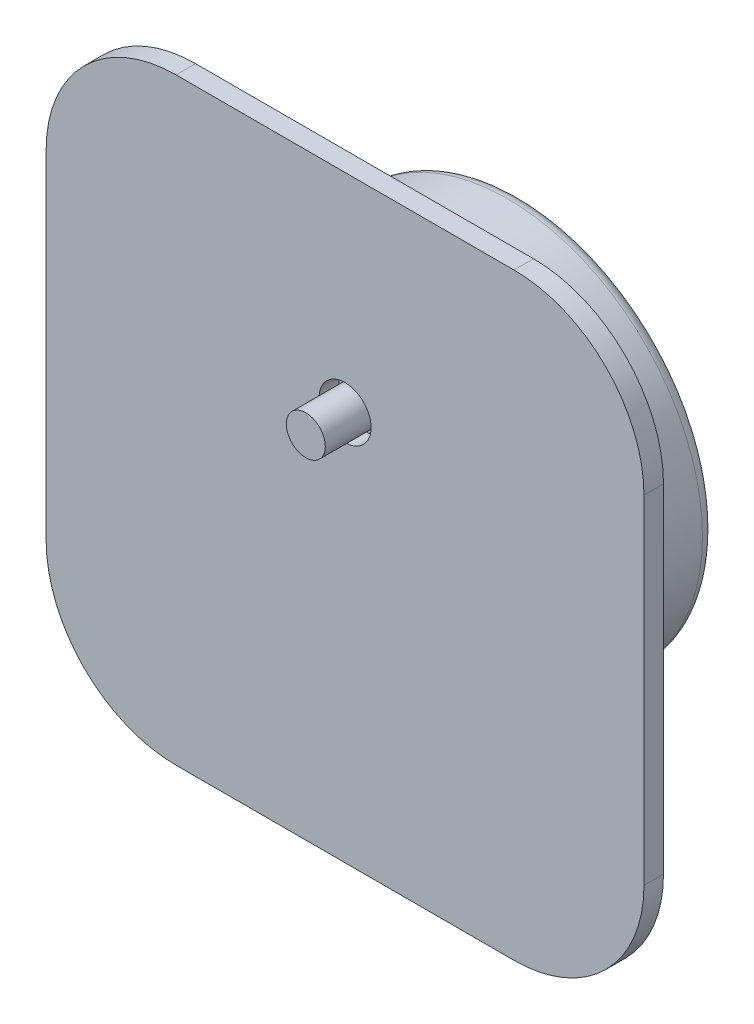
ISO-10303-21;
HEADER;
FILE_DESCRIPTION(('STEP AP214'),'2;1');
FILE_NAME('part.step','',(''),(''),'','','');
FILE_SCHEMA(('AUTOMOTIVE_DESIGN { 1 0 10303 214 1 1 1 1 }'));
ENDSEC;
DATA;
#1=APPLICATION_CONTEXT('core data for automotive mechanical design processes');
#2=APPLICATION_PROTOCOL_DEFINITION('international standard','automotive_design',2000,#1);
#3=PRODUCT_CONTEXT('',#1,'mechanical');
#4=PRODUCT('Part','Part','',(#3));
#5=PRODUCT_RELATED_PRODUCT_CATEGORY('part','',(#4));
#6=PRODUCT_DEFINITION_FORMATION('','',#4);
#7=PRODUCT_DEFINITION_CONTEXT('part definition',#1,'design');
#8=PRODUCT_DEFINITION('design','',#6,#7);
#9=PRODUCT_DEFINITION_SHAPE('','',#8);
#10=(LENGTH_UNIT() NAMED_UNIT(*) SI_UNIT(.MILLI.,.METRE.));
#11=(NAMED_UNIT(*) PLANE_ANGLE_UNIT() SI_UNIT($,.RADIAN.));
#12=(NAMED_UNIT(*) SI_UNIT($,.STERADIAN.) SOLID_ANGLE_UNIT());
#13=UNCERTAINTY_MEASURE_WITH_UNIT(LENGTH_MEASURE(1.E-05),#10,'distance_accuracy_value','');
#14=(GEOMETRIC_REPRESENTATION_CONTEXT(3) GLOBAL_UNCERTAINTY_ASSIGNED_CONTEXT((#13)) GLOBAL_UNIT_ASSIGNED_CONTEXT((#10,
#11,#12)) REPRESENTATION_CONTEXT('',''));
#15=CARTESIAN_POINT('',(0.,0.,0.));
#16=DIRECTION('',(0.,0.,1.));
#17=DIRECTION('',(1.,0.,0.));
#18=AXIS2_PLACEMENT_3D('',#15,#16,#17);
#19=CARTESIAN_POINT('',(0.,0.,1.5));
#20=DIRECTION('',(0.,0.,-1.));
#21=DIRECTION('',(-1.,0.,0.));
#22=AXIS2_PLACEMENT_3D('',#19,#20,#21);
#23=PLANE('',#22);
#24=DIRECTION('',(0.,-1.,0.));
#25=VECTOR('',#24,1.);
#26=CARTESIAN_POINT('',(-23.,-23.,1.5));
#27=LINE('',#26,#25);
#28=CARTESIAN_POINT('',(-23.,13.,1.5));
#29=VERTEX_POINT('',#28);
#30=CARTESIAN_POINT('',(-23.,-13.,1.5));
#31=VERTEX_POINT('',#30);
#32=EDGE_CURVE('E188',#29,#31,#27,.T.);
#33=ORIENTED_EDGE('',*,*,#32,.T.);
#34=CARTESIAN_POINT('',(-13.,-13.,1.5));
#35=DIRECTION('',(0.,0.,-1.));
#36=DIRECTION('',(-1.,0.,0.));
#37=AXIS2_PLACEMENT_3D('',#34,#35,#36);
#38=CIRCLE('',#37,10.);
#39=CARTESIAN_POINT('',(-13.,-23.,1.5));
#40=VERTEX_POINT('',#39);
#41=EDGE_CURVE('E286',#31,#40,#38,.F.);
#42=ORIENTED_EDGE('',*,*,#41,.T.);
#43=DIRECTION('',(1.,0.,0.));
#44=VECTOR('',#43,1.);
#45=CARTESIAN_POINT('',(-23.,-23.,1.5));
#46=LINE('',#45,#44);
#47=CARTESIAN_POINT('',(13.,-23.,1.5));
#48=VERTEX_POINT('',#47);
#49=EDGE_CURVE('E191',#40,#48,#46,.T.);
#50=ORIENTED_EDGE('',*,*,#49,.T.);
#51=CARTESIAN_POINT('',(13.,-13.,1.5));
#52=DIRECTION('',(0.,0.,-1.));
#53=DIRECTION('',(-1.,0.,0.));
#54=AXIS2_PLACEMENT_3D('',#51,#52,#53);
#55=CIRCLE('',#54,10.);
#56=CARTESIAN_POINT('',(23.,-13.,1.5));
#57=VERTEX_POINT('',#56);
#58=EDGE_CURVE('E291',#48,#57,#55,.F.);
#59=ORIENTED_EDGE('',*,*,#58,.T.);
#60=DIRECTION('',(0.,1.,0.));
#61=VECTOR('',#60,1.);
#62=CARTESIAN_POINT('',(23.,-23.,1.5));
#63=LINE('',#62,#61);
#64=CARTESIAN_POINT('',(23.,13.,1.5));
#65=VERTEX_POINT('',#64);
#66=EDGE_CURVE('E183',#57,#65,#63,.T.);
#67=ORIENTED_EDGE('',*,*,#66,.T.);
#68=CARTESIAN_POINT('',(13.,13.,1.5));
#69=DIRECTION('',(0.,0.,-1.));
#70=DIRECTION('',(-1.,0.,0.));
#71=AXIS2_PLACEMENT_3D('',#68,#69,#70);
#72=CIRCLE('',#71,10.);
#73=CARTESIAN_POINT('',(13.,23.,1.5));
#74=VERTEX_POINT('',#73);
#75=EDGE_CURVE('E58',#65,#74,#72,.F.);
#76=ORIENTED_EDGE('',*,*,#75,.T.);
#77=DIRECTION('',(-1.,0.,0.));
#78=VECTOR('',#77,1.);
#79=CARTESIAN_POINT('',(-23.,23.,1.5));
#80=LINE('',#79,#78);
#81=CARTESIAN_POINT('',(-13.,23.,1.5));
#82=VERTEX_POINT('',#81);
#83=EDGE_CURVE('E185',#74,#82,#80,.T.);
#84=ORIENTED_EDGE('',*,*,#83,.T.);
#85=CARTESIAN_POINT('',(-13.,13.,1.5));
#86=DIRECTION('',(0.,0.,-1.));
#87=DIRECTION('',(-1.,0.,0.));
#88=AXIS2_PLACEMENT_3D('',#85,#86,#87);
#89=CIRCLE('',#88,10.);
#90=EDGE_CURVE('E284',#82,#29,#89,.F.);
#91=ORIENTED_EDGE('',*,*,#90,.T.);
#92=EDGE_LOOP('',(#33,#42,#50,#59,#67,#76,#84,#91));
#93=FACE_BOUND('',#92,.T.);
#94=CARTESIAN_POINT('',(0.,7.,1.5));
#95=DIRECTION('',(0.,0.,1.));
#96=DIRECTION('',(1.,0.,0.));
#97=AXIS2_PLACEMENT_3D('',#94,#95,#96);
#98=CIRCLE('',#97,2.);
#99=CARTESIAN_POINT('',(2.,7.,1.5));
#100=VERTEX_POINT('',#99);
#101=EDGE_CURVE('E177',#100,#100,#98,.T.);
#102=ORIENTED_EDGE('',*,*,#101,.F.);
#103=EDGE_LOOP('',(#102));
#104=FACE_BOUND('',#103,.T.);
#105=ADVANCED_FACE('F36',(#93,#104),#23,.F.);
#106=CARTESIAN_POINT('',(0.,0.,0.));
#107=DIRECTION('',(0.,0.,-1.));
#108=DIRECTION('',(-1.,0.,0.));
#109=AXIS2_PLACEMENT_3D('',#106,#107,#108);
#110=PLANE('',#109);
#111=DIRECTION('',(-1.,0.,0.));
#112=VECTOR('',#111,1.);
#113=CARTESIAN_POINT('',(-16.0452967958349,-5.50147784542147,0.));
#114=LINE('',#113,#112);
#115=CARTESIAN_POINT('',(-13.9547032041651,-5.50147784542147,0.));
#116=VERTEX_POINT('',#115);
#117=CARTESIAN_POINT('',(-16.0452967958349,-5.50147784542147,0.));
#118=VERTEX_POINT('',#117);
#119=EDGE_CURVE('E149',#116,#118,#114,.T.);
#120=ORIENTED_EDGE('',*,*,#119,.F.);
#121=CARTESIAN_POINT('',(0.,0.,0.));
#122=DIRECTION('',(0.,0.,-1.));
#123=DIRECTION('',(-1.,0.,0.));
#124=AXIS2_PLACEMENT_3D('',#121,#122,#123);
#125=CIRCLE('',#124,15.);
#126=CARTESIAN_POINT('',(-13.9547032041651,5.50147784542147,0.));
#127=VERTEX_POINT('',#126);
#128=EDGE_CURVE('E142',#127,#116,#125,.T.);
#129=ORIENTED_EDGE('',*,*,#128,.F.);
#130=DIRECTION('',(1.,0.,0.));
#131=VECTOR('',#130,1.);
#132=CARTESIAN_POINT('',(-16.0452967958349,5.50147784542147,0.));
#133=LINE('',#132,#131);
#134=CARTESIAN_POINT('',(-16.0452967958349,5.50147784542147,0.));
#135=VERTEX_POINT('',#134);
#136=EDGE_CURVE('E168',#135,#127,#133,.T.);
#137=ORIENTED_EDGE('',*,*,#136,.F.);
#138=DIRECTION('',(0.,1.,0.));
#139=VECTOR('',#138,1.);
#140=CARTESIAN_POINT('',(-16.0452967958349,-5.50147784542147,0.));
#141=LINE('',#140,#139);
#142=EDGE_CURVE('E165',#118,#135,#141,.T.);
#143=ORIENTED_EDGE('',*,*,#142,.F.);
#144=EDGE_LOOP('',(#120,#129,#137,#143));
#145=FACE_BOUND('',#144,.T.);
#146=DIRECTION('',(1.,0.,0.));
#147=VECTOR('',#146,1.);
#148=CARTESIAN_POINT('',(-23.,-23.,0.));
#149=LINE('',#148,#147);
#150=CARTESIAN_POINT('',(-13.,-23.,0.));
#151=VERTEX_POINT('',#150);
#152=CARTESIAN_POINT('',(13.,-23.,0.));
#153=VERTEX_POINT('',#152);
#154=EDGE_CURVE('E186',#151,#153,#149,.T.);
#155=ORIENTED_EDGE('',*,*,#154,.F.);
#156=CARTESIAN_POINT('',(-13.,-13.,0.));
#157=DIRECTION('',(0.,0.,-1.));
#158=DIRECTION('',(-1.,0.,0.));
#159=AXIS2_PLACEMENT_3D('',#156,#157,#158);
#160=CIRCLE('',#159,10.);
#161=CARTESIAN_POINT('',(-23.,-13.,0.));
#162=VERTEX_POINT('',#161);
#163=EDGE_CURVE('E298',#151,#162,#160,.T.);
#164=ORIENTED_EDGE('',*,*,#163,.T.);
#165=DIRECTION('',(0.,-1.,0.));
#166=VECTOR('',#165,1.);
#167=CARTESIAN_POINT('',(-23.,-23.,0.));
#168=LINE('',#167,#166);
#169=CARTESIAN_POINT('',(-23.,13.,0.));
#170=VERTEX_POINT('',#169);
#171=EDGE_CURVE('E198',#170,#162,#168,.T.);
#172=ORIENTED_EDGE('',*,*,#171,.F.);
#173=CARTESIAN_POINT('',(-13.,13.,0.));
#174=DIRECTION('',(0.,0.,-1.));
#175=DIRECTION('',(-1.,0.,0.));
#176=AXIS2_PLACEMENT_3D('',#173,#174,#175);
#177=CIRCLE('',#176,10.);
#178=CARTESIAN_POINT('',(-13.,23.,0.));
#179=VERTEX_POINT('',#178);
#180=EDGE_CURVE('E282',#170,#179,#177,.T.);
#181=ORIENTED_EDGE('',*,*,#180,.T.);
#182=DIRECTION('',(-1.,0.,0.));
#183=VECTOR('',#182,1.);
#184=CARTESIAN_POINT('',(-23.,23.,0.));
#185=LINE('',#184,#183);
#186=CARTESIAN_POINT('',(13.,23.,0.));
#187=VERTEX_POINT('',#186);
#188=EDGE_CURVE('E196',#187,#179,#185,.T.);
#189=ORIENTED_EDGE('',*,*,#188,.F.);
#190=CARTESIAN_POINT('',(13.,13.,0.));
#191=DIRECTION('',(0.,0.,-1.));
#192=DIRECTION('',(-1.,0.,0.));
#193=AXIS2_PLACEMENT_3D('',#190,#191,#192);
#194=CIRCLE('',#193,10.);
#195=CARTESIAN_POINT('',(23.,13.,0.));
#196=VERTEX_POINT('',#195);
#197=EDGE_CURVE('E303',#187,#196,#194,.T.);
#198=ORIENTED_EDGE('',*,*,#197,.T.);
#199=DIRECTION('',(0.,1.,0.));
#200=VECTOR('',#199,1.);
#201=CARTESIAN_POINT('',(23.,-23.,0.));
#202=LINE('',#201,#200);
#203=CARTESIAN_POINT('',(23.,-13.,0.));
#204=VERTEX_POINT('',#203);
#205=EDGE_CURVE('E180',#204,#196,#202,.T.);
#206=ORIENTED_EDGE('',*,*,#205,.F.);
#207=CARTESIAN_POINT('',(13.,-13.,0.));
#208=DIRECTION('',(0.,0.,-1.));
#209=DIRECTION('',(-1.,0.,0.));
#210=AXIS2_PLACEMENT_3D('',#207,#208,#209);
#211=CIRCLE('',#210,10.);
#212=EDGE_CURVE('E301',#204,#153,#211,.T.);
#213=ORIENTED_EDGE('',*,*,#212,.T.);
#214=EDGE_LOOP('',(#155,#164,#172,#181,#189,#198,#206,#213));
#215=FACE_BOUND('',#214,.T.);
#216=ADVANCED_FACE('F252',(#145,#215),#110,.T.);
#217=CARTESIAN_POINT('',(23.,-23.,1.5));
#218=DIRECTION('',(-1.,0.,0.));
#219=DIRECTION('',(0.,0.,1.));
#220=AXIS2_PLACEMENT_3D('',#217,#218,#219);
#221=PLANE('',#220);
#222=ORIENTED_EDGE('',*,*,#66,.F.);
#223=DIRECTION('',(0.,0.,-1.));
#224=VECTOR('',#223,1.);
#225=CARTESIAN_POINT('',(23.,-13.,1.5));
#226=LINE('',#225,#224);
#227=EDGE_CURVE('E11',#57,#204,#226,.T.);
#228=ORIENTED_EDGE('',*,*,#227,.T.);
#229=ORIENTED_EDGE('',*,*,#205,.T.);
#230=DIRECTION('',(0.,0.,-1.));
#231=VECTOR('',#230,1.);
#232=CARTESIAN_POINT('',(23.,13.,1.5));
#233=LINE('',#232,#231);
#234=EDGE_CURVE('E44',#196,#65,#233,.F.);
#235=ORIENTED_EDGE('',*,*,#234,.T.);
#236=EDGE_LOOP('',(#222,#228,#229,#235));
#237=FACE_BOUND('',#236,.T.);
#238=ADVANCED_FACE('F232',(#237),#221,.F.);
#239=CARTESIAN_POINT('',(-23.,23.,1.5));
#240=DIRECTION('',(0.,-1.,0.));
#241=DIRECTION('',(0.,0.,-1.));
#242=AXIS2_PLACEMENT_3D('',#239,#240,#241);
#243=PLANE('',#242);
#244=ORIENTED_EDGE('',*,*,#188,.T.);
#245=DIRECTION('',(0.,0.,-1.));
#246=VECTOR('',#245,1.);
#247=CARTESIAN_POINT('',(-13.,23.,1.5));
#248=LINE('',#247,#246);
#249=EDGE_CURVE('E51',#179,#82,#248,.F.);
#250=ORIENTED_EDGE('',*,*,#249,.T.);
#251=ORIENTED_EDGE('',*,*,#83,.F.);
#252=DIRECTION('',(0.,0.,-1.));
#253=VECTOR('',#252,1.);
#254=CARTESIAN_POINT('',(13.,23.,1.5));
#255=LINE('',#254,#253);
#256=EDGE_CURVE('E278',#74,#187,#255,.T.);
#257=ORIENTED_EDGE('',*,*,#256,.T.);
#258=EDGE_LOOP('',(#244,#250,#251,#257));
#259=FACE_BOUND('',#258,.T.);
#260=ADVANCED_FACE('F268',(#259),#243,.F.);
#261=CARTESIAN_POINT('',(-23.,-23.,1.5));
#262=DIRECTION('',(1.,0.,0.));
#263=DIRECTION('',(0.,0.,-1.));
#264=AXIS2_PLACEMENT_3D('',#261,#262,#263);
#265=PLANE('',#264);
#266=ORIENTED_EDGE('',*,*,#171,.T.);
#267=DIRECTION('',(0.,0.,-1.));
#268=VECTOR('',#267,1.);
#269=CARTESIAN_POINT('',(-23.,-13.,1.5));
#270=LINE('',#269,#268);
#271=EDGE_CURVE('E294',#162,#31,#270,.F.);
#272=ORIENTED_EDGE('',*,*,#271,.T.);
#273=ORIENTED_EDGE('',*,*,#32,.F.);
#274=DIRECTION('',(0.,0.,-1.));
#275=VECTOR('',#274,1.);
#276=CARTESIAN_POINT('',(-23.,13.,1.5));
#277=LINE('',#276,#275);
#278=EDGE_CURVE('E296',#29,#170,#277,.T.);
#279=ORIENTED_EDGE('',*,*,#278,.T.);
#280=EDGE_LOOP('',(#266,#272,#273,#279));
#281=FACE_BOUND('',#280,.T.);
#282=ADVANCED_FACE('F265',(#281),#265,.F.);
#283=CARTESIAN_POINT('',(-23.,-23.,1.5));
#284=DIRECTION('',(0.,1.,0.));
#285=DIRECTION('',(0.,0.,1.));
#286=AXIS2_PLACEMENT_3D('',#283,#284,#285);
#287=PLANE('',#286);
#288=ORIENTED_EDGE('',*,*,#49,.F.);
#289=DIRECTION('',(0.,0.,-1.));
#290=VECTOR('',#289,1.);
#291=CARTESIAN_POINT('',(-13.,-23.,1.5));
#292=LINE('',#291,#290);
#293=EDGE_CURVE('E305',#40,#151,#292,.T.);
#294=ORIENTED_EDGE('',*,*,#293,.T.);
#295=ORIENTED_EDGE('',*,*,#154,.T.);
#296=DIRECTION('',(0.,0.,-1.));
#297=VECTOR('',#296,1.);
#298=CARTESIAN_POINT('',(13.,-23.,1.5));
#299=LINE('',#298,#297);
#300=EDGE_CURVE('E307',#153,#48,#299,.F.);
#301=ORIENTED_EDGE('',*,*,#300,.T.);
#302=EDGE_LOOP('',(#288,#294,#295,#301));
#303=FACE_BOUND('',#302,.T.);
#304=ADVANCED_FACE('F262',(#303),#287,.F.);
#305=CARTESIAN_POINT('',(0.,7.,1.5));
#306=DIRECTION('',(0.,0.,-1.));
#307=DIRECTION('',(-1.,0.,0.));
#308=AXIS2_PLACEMENT_3D('',#305,#306,#307);
#309=CYLINDRICAL_SURFACE('',#308,2.);
#310=ORIENTED_EDGE('',*,*,#101,.T.);
#311=EDGE_LOOP('',(#310));
#312=FACE_BOUND('',#311,.T.);
#313=CARTESIAN_POINT('',(0.,7.,0.));
#314=DIRECTION('',(0.,0.,1.));
#315=DIRECTION('',(1.,0.,0.));
#316=AXIS2_PLACEMENT_3D('',#313,#314,#315);
#317=CIRCLE('',#316,2.);
#318=CARTESIAN_POINT('',(2.,7.,0.));
#319=VERTEX_POINT('',#318);
#320=EDGE_CURVE('E176',#319,#319,#317,.T.);
#321=ORIENTED_EDGE('',*,*,#320,.F.);
#322=EDGE_LOOP('',(#321));
#323=FACE_BOUND('',#322,.T.);
#324=ADVANCED_FACE('F260',(#312,#323),#309,.F.);
#325=CARTESIAN_POINT('',(0.,0.,-12.));
#326=DIRECTION('',(0.,0.,1.));
#327=DIRECTION('',(1.,0.,0.));
#328=AXIS2_PLACEMENT_3D('',#325,#326,#327);
#329=PLANE('',#328);
#330=CARTESIAN_POINT('',(0.,0.,-12.));
#331=DIRECTION('',(0.,0.,1.));
#332=DIRECTION('',(1.,0.,0.));
#333=AXIS2_PLACEMENT_3D('',#330,#331,#332);
#334=CIRCLE('',#333,14.);
#335=CARTESIAN_POINT('',(-12.8737617469152,5.50147784542147,-12.));
#336=VERTEX_POINT('',#335);
#337=CARTESIAN_POINT('',(-12.8737617469152,-5.50147784542147,-12.));
#338=VERTEX_POINT('',#337);
#339=EDGE_CURVE('E139',#336,#338,#334,.F.);
#340=ORIENTED_EDGE('',*,*,#339,.T.);
#341=DIRECTION('',(-1.,0.,0.));
#342=VECTOR('',#341,1.);
#343=CARTESIAN_POINT('',(-16.0452967958349,-5.50147784542147,-12.));
#344=LINE('',#343,#342);
#345=CARTESIAN_POINT('',(-16.0452967958349,-5.50147784542147,-12.));
#346=VERTEX_POINT('',#345);
#347=EDGE_CURVE('E132',#338,#346,#344,.T.);
#348=ORIENTED_EDGE('',*,*,#347,.T.);
#349=DIRECTION('',(0.,1.,0.));
#350=VECTOR('',#349,1.);
#351=CARTESIAN_POINT('',(-16.0452967958349,-5.50147784542147,-12.));
#352=LINE('',#351,#350);
#353=CARTESIAN_POINT('',(-16.0452967958349,5.50147784542147,-12.));
#354=VERTEX_POINT('',#353);
#355=EDGE_CURVE('E136',#346,#354,#352,.T.);
#356=ORIENTED_EDGE('',*,*,#355,.T.);
#357=DIRECTION('',(1.,0.,0.));
#358=VECTOR('',#357,1.);
#359=CARTESIAN_POINT('',(-16.0452967958349,5.50147784542147,-12.));
#360=LINE('',#359,#358);
#361=EDGE_CURVE('E158',#354,#336,#360,.T.);
#362=ORIENTED_EDGE('',*,*,#361,.T.);
#363=EDGE_LOOP('',(#340,#348,#356,#362));
#364=FACE_BOUND('',#363,.T.);
#365=ADVANCED_FACE('F134',(#364),#329,.F.);
#366=CARTESIAN_POINT('',(0.,0.,-12.));
#367=DIRECTION('',(0.,0.,1.));
#368=DIRECTION('',(1.,0.,0.));
#369=AXIS2_PLACEMENT_3D('',#366,#367,#368);
#370=CYLINDRICAL_SURFACE('',#369,15.);
#371=DIRECTION('',(0.,0.,1.));
#372=VECTOR('',#371,1.);
#373=CARTESIAN_POINT('',(-13.9547032041651,-5.50147784542147,-12.));
#374=LINE('',#373,#372);
#375=CARTESIAN_POINT('',(-13.9547032041651,-5.50147784542147,-11.));
#376=VERTEX_POINT('',#375);
#377=EDGE_CURVE('E152',#376,#116,#374,.T.);
#378=ORIENTED_EDGE('',*,*,#377,.F.);
#379=CARTESIAN_POINT('',(0.,0.,-11.));
#380=DIRECTION('',(0.,0.,1.));
#381=DIRECTION('',(1.,0.,0.));
#382=AXIS2_PLACEMENT_3D('',#379,#380,#381);
#383=CIRCLE('',#382,15.);
#384=CARTESIAN_POINT('',(-13.9547032041651,5.50147784542147,-11.));
#385=VERTEX_POINT('',#384);
#386=EDGE_CURVE('E204',#376,#385,#383,.T.);
#387=ORIENTED_EDGE('',*,*,#386,.T.);
#388=DIRECTION('',(0.,0.,1.));
#389=VECTOR('',#388,1.);
#390=CARTESIAN_POINT('',(-13.9547032041651,5.50147784542147,-12.));
#391=LINE('',#390,#389);
#392=EDGE_CURVE('E160',#385,#127,#391,.T.);
#393=ORIENTED_EDGE('',*,*,#392,.T.);
#394=ORIENTED_EDGE('',*,*,#128,.T.);
#395=EDGE_LOOP('',(#378,#387,#393,#394));
#396=FACE_BOUND('',#395,.T.);
#397=ADVANCED_FACE('F318',(#396),#370,.T.);
#398=CARTESIAN_POINT('',(-16.0452967958349,5.50147784542147,-12.));
#399=DIRECTION('',(0.,-1.,0.));
#400=DIRECTION('',(0.,0.,-1.));
#401=AXIS2_PLACEMENT_3D('',#398,#399,#400);
#402=PLANE('',#401);
#403=ORIENTED_EDGE('',*,*,#136,.T.);
#404=ORIENTED_EDGE('',*,*,#392,.F.);
#405=CARTESIAN_POINT('',(-13.9547032041651,5.50147784542147,-11.));
#406=CARTESIAN_POINT('',(-13.954703969301,5.50147784542147,-11.0266923338133));
#407=CARTESIAN_POINT('',(-13.9535536284371,5.50147784542147,-11.0533713751042));
#408=CARTESIAN_POINT('',(-13.9489709058301,5.50147784542147,-11.1065279359718));
#409=CARTESIAN_POINT('',(-13.9455389378121,5.50147784542147,-11.1330054912035));
#410=CARTESIAN_POINT('',(-13.9318816361717,5.50147784542147,-11.2117070622914));
#411=CARTESIAN_POINT('',(-13.9182945817076,5.50147784542147,-11.263386134094));
#412=CARTESIAN_POINT('',(-13.8826779798545,5.50147784542147,-11.3636969363667));
#413=CARTESIAN_POINT('',(-13.8606498082545,5.50147784542147,-11.41232916193));
#414=CARTESIAN_POINT('',(-13.8089498364463,5.50147784542147,-11.5053574380949));
#415=CARTESIAN_POINT('',(-13.7792754300045,5.50147784542147,-11.5497520372088));
#416=CARTESIAN_POINT('',(-13.7123711390324,5.50147784542147,-11.6344219310899));
#417=CARTESIAN_POINT('',(-13.6749559507055,5.50147784542147,-11.6745504054429));
#418=CARTESIAN_POINT('',(-13.5942953333649,5.50147784542147,-11.748429682378));
#419=CARTESIAN_POINT('',(-13.5510486460569,5.50147784542147,-11.7821791047321));
#420=CARTESIAN_POINT('',(-13.4569277185261,5.50147784542147,-11.8447303889756));
#421=CARTESIAN_POINT('',(-13.4057381375873,5.50147784542147,-11.8730571997512));
#422=CARTESIAN_POINT('',(-13.2995512928456,5.50147784542147,-11.9213815707239));
#423=CARTESIAN_POINT('',(-13.2445520680181,5.50147784542147,-11.9413748034697));
#424=CARTESIAN_POINT('',(-13.1371939582059,5.50147784542147,-11.971379821219));
#425=CARTESIAN_POINT('',(-13.0850368591682,5.50147784542147,-11.9821225996744));
#426=CARTESIAN_POINT('',(-12.9798374799991,5.50147784542147,-11.9964323750728));
#427=CARTESIAN_POINT('',(-12.9267968885177,5.50147784542147,-12.0000117619091));
#428=CARTESIAN_POINT('',(-12.8737617469152,5.50147784542147,-12.));
#429=B_SPLINE_CURVE_WITH_KNOTS('',3,(#405,#406,#407,#408,#409,#410,#411,#412,#413,#414,#415,
#416,#417,#418,#419,#420,#421,#422,#423,#424,#425,#426,#427,#428),.UNSPECIFIED.,.F.,.F.,(4,2,2,
2,2,2,2,2,2,2,2,4),(0.,0.0800260841464288,0.160037661200693,0.319509714676389,0.478955787388967,
0.63845627965496,0.802342212014459,0.966263563688309,1.14102985408507,1.31588678421206,
1.47515390956494,1.63414532556858),.UNSPECIFIED.);
#430=EDGE_CURVE('E214',#385,#336,#429,.T.);
#431=ORIENTED_EDGE('',*,*,#430,.T.);
#432=ORIENTED_EDGE('',*,*,#361,.F.);
#433=DIRECTION('',(0.,0.,1.));
#434=VECTOR('',#433,1.);
#435=CARTESIAN_POINT('',(-16.0452967958349,5.50147784542147,-12.));
#436=LINE('',#435,#434);
#437=EDGE_CURVE('E153',#354,#135,#436,.T.);
#438=ORIENTED_EDGE('',*,*,#437,.T.);
#439=EDGE_LOOP('',(#403,#404,#431,#432,#438));
#440=FACE_BOUND('',#439,.T.);
#441=ADVANCED_FACE('F314',(#440),#402,.F.);
#442=CARTESIAN_POINT('',(-16.0452967958349,-5.50147784542147,-12.));
#443=DIRECTION('',(1.,0.,0.));
#444=DIRECTION('',(0.,0.,-1.));
#445=AXIS2_PLACEMENT_3D('',#442,#443,#444);
#446=PLANE('',#445);
#447=ORIENTED_EDGE('',*,*,#142,.T.);
#448=ORIENTED_EDGE('',*,*,#437,.F.);
#449=ORIENTED_EDGE('',*,*,#355,.F.);
#450=DIRECTION('',(0.,0.,1.));
#451=VECTOR('',#450,1.);
#452=CARTESIAN_POINT('',(-16.0452967958349,-5.50147784542147,-12.));
#453=LINE('',#452,#451);
#454=EDGE_CURVE('E146',#346,#118,#453,.T.);
#455=ORIENTED_EDGE('',*,*,#454,.T.);
#456=EDGE_LOOP('',(#447,#448,#449,#455));
#457=FACE_BOUND('',#456,.T.);
#458=ADVANCED_FACE('F155',(#457),#446,.F.);
#459=CARTESIAN_POINT('',(-16.0452967958349,-5.50147784542147,-12.));
#460=DIRECTION('',(0.,1.,0.));
#461=DIRECTION('',(0.,0.,1.));
#462=AXIS2_PLACEMENT_3D('',#459,#460,#461);
#463=PLANE('',#462);
#464=ORIENTED_EDGE('',*,*,#119,.T.);
#465=ORIENTED_EDGE('',*,*,#454,.F.);
#466=ORIENTED_EDGE('',*,*,#347,.F.);
#467=CARTESIAN_POINT('',(-12.8737617469152,-5.50147784542147,-12.));
#468=CARTESIAN_POINT('',(-12.938544959635,-5.50147784542147,-12.0000320878294));
#469=CARTESIAN_POINT('',(-13.0033566388916,-5.50147784542147,-11.9946773508154));
#470=CARTESIAN_POINT('',(-13.1313367803267,-5.50147784542147,-11.973305422742));
#471=CARTESIAN_POINT('',(-13.1945013936014,-5.50147784542147,-11.9572652414244));
#472=CARTESIAN_POINT('',(-13.3172909065566,-5.50147784542147,-11.914600113824));
#473=CARTESIAN_POINT('',(-13.3769099151725,-5.50147784542147,-11.8879580877501));
#474=CARTESIAN_POINT('',(-13.4904555969724,-5.50147784542147,-11.8245614994544));
#475=CARTESIAN_POINT('',(-13.5443883549478,-5.50147784542147,-11.7878179019279));
#476=CARTESIAN_POINT('',(-13.6421106315783,-5.50147784542147,-11.7070569706447));
#477=CARTESIAN_POINT('',(-13.6862686852584,-5.50147784542147,-11.6634865365496));
#478=CARTESIAN_POINT('',(-13.7659183345191,-5.50147784542147,-11.5689919470505));
#479=CARTESIAN_POINT('',(-13.8014103226159,-5.50147784542147,-11.5180681248732));
#480=CARTESIAN_POINT('',(-13.8598184863846,-5.50147784542147,-11.4145374979073));
#481=CARTESIAN_POINT('',(-13.8834859439927,-5.50147784542147,-11.3623534211996));
#482=CARTESIAN_POINT('',(-13.9210446041254,-5.50147784542147,-11.2546200296116));
#483=CARTESIAN_POINT('',(-13.9349527106532,-5.50147784542147,-11.1990767154238));
#484=CARTESIAN_POINT('',(-13.9473544169948,-5.50147784542147,-11.1191656445857));
#485=CARTESIAN_POINT('',(-13.9501098139308,-5.50147784542147,-11.0953975795518));
#486=CARTESIAN_POINT('',(-13.9537823582647,-5.50147784542147,-11.047757201873));
#487=CARTESIAN_POINT('',(-13.9547023703323,-5.50147784542147,-11.0238851100577));
#488=CARTESIAN_POINT('',(-13.9547032041652,-5.50147784542147,-11.));
#489=B_SPLINE_CURVE_WITH_KNOTS('',3,(#467,#468,#469,#470,#471,#472,#473,#474,#475,#476,#477,
#478,#479,#480,#481,#482,#483,#484,#485,#486,#487,#488),.UNSPECIFIED.,.F.,.F.,(4,2,2,2,2,2,2,2,
2,2,4),(0.,0.1941760529545,0.388771240385019,0.583681202154336,0.778380429636134,
0.963498867131353,1.14860891841457,1.31963714721937,1.49036840484493,1.56209225176241,
1.63370406420081),.UNSPECIFIED.);
#490=EDGE_CURVE('E206',#338,#376,#489,.T.);
#491=ORIENTED_EDGE('',*,*,#490,.T.);
#492=ORIENTED_EDGE('',*,*,#377,.T.);
#493=EDGE_LOOP('',(#464,#465,#466,#491,#492));
#494=FACE_BOUND('',#493,.T.);
#495=ADVANCED_FACE('F147',(#494),#463,.F.);
#496=CARTESIAN_POINT('',(0.,0.,0.));
#497=DIRECTION('',(0.,0.,1.));
#498=DIRECTION('',(1.,0.,0.));
#499=AXIS2_PLACEMENT_3D('',#496,#497,#498);
#500=PLANE('',#499);
#501=CARTESIAN_POINT('',(0.,7.,0.));
#502=DIRECTION('',(0.,0.,1.));
#503=DIRECTION('',(1.,0.,0.));
#504=AXIS2_PLACEMENT_3D('',#501,#502,#503);
#505=CIRCLE('',#504,1.5);
#506=CARTESIAN_POINT('',(1.5,7.,0.));
#507=VERTEX_POINT('',#506);
#508=EDGE_CURVE('E352',#507,#507,#505,.T.);
#509=ORIENTED_EDGE('',*,*,#508,.F.);
#510=EDGE_LOOP('',(#509));
#511=FACE_BOUND('',#510,.T.);
#512=ORIENTED_EDGE('',*,*,#320,.T.);
#513=EDGE_LOOP('',(#512));
#514=FACE_BOUND('',#513,.T.);
#515=ADVANCED_FACE('F230',(#511,#514),#500,.T.);
#516=CARTESIAN_POINT('',(0.,0.,-11.));
#517=DIRECTION('',(0.,0.,1.));
#518=DIRECTION('',(1.,0.,0.));
#519=AXIS2_PLACEMENT_3D('',#516,#517,#518);
#520=TOROIDAL_SURFACE('',#519,14.,1.);
#521=ORIENTED_EDGE('',*,*,#430,.F.);
#522=ORIENTED_EDGE('',*,*,#386,.F.);
#523=ORIENTED_EDGE('',*,*,#490,.F.);
#524=ORIENTED_EDGE('',*,*,#339,.F.);
#525=EDGE_LOOP('',(#521,#522,#523,#524));
#526=FACE_BOUND('',#525,.T.);
#527=ADVANCED_FACE('F224',(#526),#520,.T.);
#528=CARTESIAN_POINT('',(0.,7.,4.52));
#529=DIRECTION('',(0.,0.,-1.));
#530=DIRECTION('',(-1.,0.,0.));
#531=AXIS2_PLACEMENT_3D('',#528,#529,#530);
#532=CYLINDRICAL_SURFACE('',#531,1.5);
#533=CARTESIAN_POINT('',(0.,7.,4.52));
#534=DIRECTION('',(0.,0.,1.));
#535=DIRECTION('',(1.,0.,0.));
#536=AXIS2_PLACEMENT_3D('',#533,#534,#535);
#537=CIRCLE('',#536,1.5);
#538=CARTESIAN_POINT('',(1.5,7.,4.52));
#539=VERTEX_POINT('',#538);
#540=EDGE_CURVE('E166',#539,#539,#537,.T.);
#541=ORIENTED_EDGE('',*,*,#540,.F.);
#542=EDGE_LOOP('',(#541));
#543=FACE_BOUND('',#542,.T.);
#544=ORIENTED_EDGE('',*,*,#508,.T.);
#545=EDGE_LOOP('',(#544));
#546=FACE_BOUND('',#545,.T.);
#547=ADVANCED_FACE('F229',(#543,#546),#532,.T.);
#548=CARTESIAN_POINT('',(0.,7.,4.52));
#549=DIRECTION('',(0.,0.,1.));
#550=DIRECTION('',(1.,0.,0.));
#551=AXIS2_PLACEMENT_3D('',#548,#549,#550);
#552=PLANE('',#551);
#553=ORIENTED_EDGE('',*,*,#540,.T.);
#554=EDGE_LOOP('',(#553));
#555=FACE_BOUND('',#554,.T.);
#556=ADVANCED_FACE('F239',(#555),#552,.T.);
#557=CARTESIAN_POINT('',(-13.,-13.,1.5));
#558=DIRECTION('',(0.,0.,-1.));
#559=DIRECTION('',(-1.,0.,0.));
#560=AXIS2_PLACEMENT_3D('',#557,#558,#559);
#561=CYLINDRICAL_SURFACE('',#560,10.);
#562=ORIENTED_EDGE('',*,*,#41,.F.);
#563=ORIENTED_EDGE('',*,*,#271,.F.);
#564=ORIENTED_EDGE('',*,*,#163,.F.);
#565=ORIENTED_EDGE('',*,*,#293,.F.);
#566=EDGE_LOOP('',(#562,#563,#564,#565));
#567=FACE_BOUND('',#566,.T.);
#568=ADVANCED_FACE('F234',(#567),#561,.T.);
#569=CARTESIAN_POINT('',(-13.,13.,1.5));
#570=DIRECTION('',(0.,0.,-1.));
#571=DIRECTION('',(-1.,0.,0.));
#572=AXIS2_PLACEMENT_3D('',#569,#570,#571);
#573=CYLINDRICAL_SURFACE('',#572,10.);
#574=ORIENTED_EDGE('',*,*,#90,.F.);
#575=ORIENTED_EDGE('',*,*,#249,.F.);
#576=ORIENTED_EDGE('',*,*,#180,.F.);
#577=ORIENTED_EDGE('',*,*,#278,.F.);
#578=EDGE_LOOP('',(#574,#575,#576,#577));
#579=FACE_BOUND('',#578,.T.);
#580=ADVANCED_FACE('F238',(#579),#573,.T.);
#581=CARTESIAN_POINT('',(13.,-13.,1.5));
#582=DIRECTION('',(0.,0.,-1.));
#583=DIRECTION('',(-1.,0.,0.));
#584=AXIS2_PLACEMENT_3D('',#581,#582,#583);
#585=CYLINDRICAL_SURFACE('',#584,10.);
#586=ORIENTED_EDGE('',*,*,#58,.F.);
#587=ORIENTED_EDGE('',*,*,#300,.F.);
#588=ORIENTED_EDGE('',*,*,#212,.F.);
#589=ORIENTED_EDGE('',*,*,#227,.F.);
#590=EDGE_LOOP('',(#586,#587,#588,#589));
#591=FACE_BOUND('',#590,.T.);
#592=ADVANCED_FACE('F242',(#591),#585,.T.);
#593=CARTESIAN_POINT('',(13.,13.,1.5));
#594=DIRECTION('',(0.,0.,-1.));
#595=DIRECTION('',(-1.,0.,0.));
#596=AXIS2_PLACEMENT_3D('',#593,#594,#595);
#597=CYLINDRICAL_SURFACE('',#596,10.);
#598=ORIENTED_EDGE('',*,*,#75,.F.);
#599=ORIENTED_EDGE('',*,*,#234,.F.);
#600=ORIENTED_EDGE('',*,*,#197,.F.);
#601=ORIENTED_EDGE('',*,*,#256,.F.);
#602=EDGE_LOOP('',(#598,#599,#600,#601));
#603=FACE_BOUND('',#602,.T.);
#604=ADVANCED_FACE('F38',(#603),#597,.T.);
#605=CLOSED_SHELL('',(#105,#216,#238,#260,#282,#304,#324,#365,#397,#441,#458,#495,#515,#527,
#547,#556,#568,#580,#592,#604));
#606=MANIFOLD_SOLID_BREP('B2',#605);
#607=ADVANCED_BREP_SHAPE_REPRESENTATION('',(#18,#606),#14);
#608=SHAPE_DEFINITION_REPRESENTATION(#9,#607);
ENDSEC;
END-ISO-10303-21;
